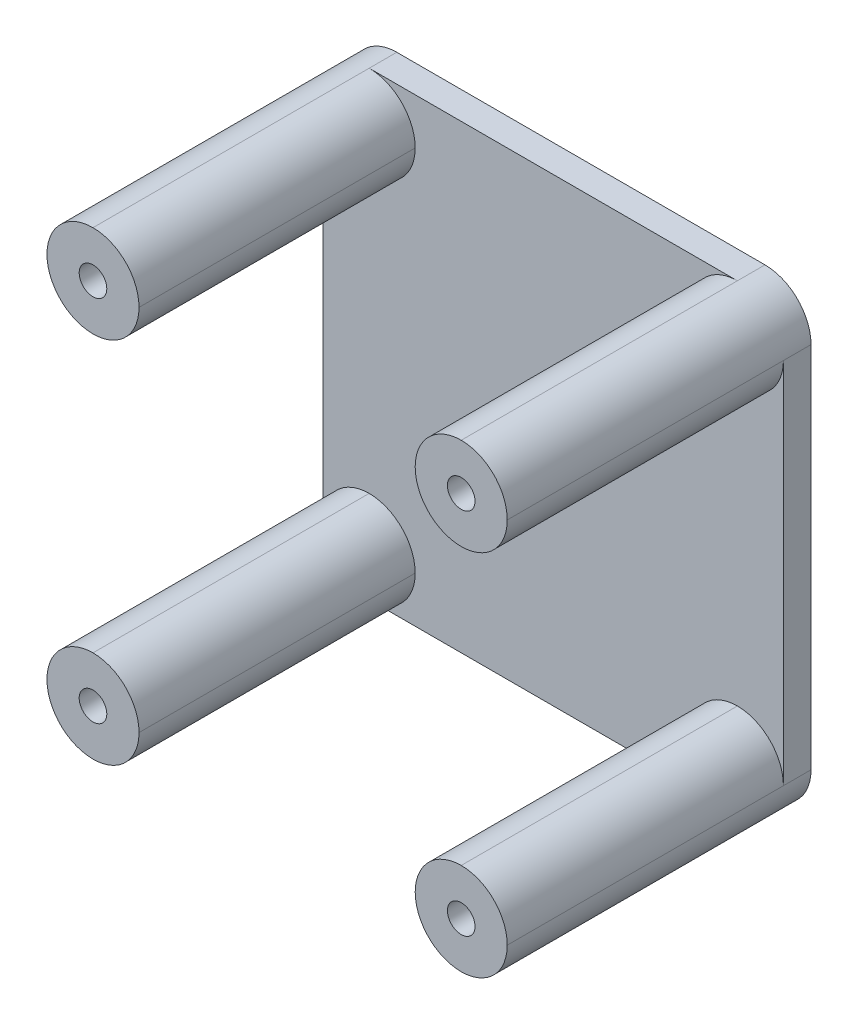
ISO-10303-21;
HEADER;
FILE_DESCRIPTION(('STEP AP214'),'2;1');
FILE_NAME('part.step','',(''),(''),'','','');
FILE_SCHEMA(('AUTOMOTIVE_DESIGN { 1 0 10303 214 1 1 1 1 }'));
ENDSEC;
DATA;
#1=APPLICATION_CONTEXT('core data for automotive mechanical design processes');
#2=APPLICATION_PROTOCOL_DEFINITION('international standard','automotive_design',2000,#1);
#3=PRODUCT_CONTEXT('',#1,'mechanical');
#4=PRODUCT('Part','Part','',(#3));
#5=PRODUCT_RELATED_PRODUCT_CATEGORY('part','',(#4));
#6=PRODUCT_DEFINITION_FORMATION('','',#4);
#7=PRODUCT_DEFINITION_CONTEXT('part definition',#1,'design');
#8=PRODUCT_DEFINITION('design','',#6,#7);
#9=PRODUCT_DEFINITION_SHAPE('','',#8);
#10=(LENGTH_UNIT() NAMED_UNIT(*) SI_UNIT(.MILLI.,.METRE.));
#11=(NAMED_UNIT(*) PLANE_ANGLE_UNIT() SI_UNIT($,.RADIAN.));
#12=(NAMED_UNIT(*) SI_UNIT($,.STERADIAN.) SOLID_ANGLE_UNIT());
#13=UNCERTAINTY_MEASURE_WITH_UNIT(LENGTH_MEASURE(1.E-05),#10,'distance_accuracy_value','');
#14=(GEOMETRIC_REPRESENTATION_CONTEXT(3) GLOBAL_UNCERTAINTY_ASSIGNED_CONTEXT((#13)) GLOBAL_UNIT_ASSIGNED_CONTEXT((#10,
#11,#12)) REPRESENTATION_CONTEXT('',''));
#15=CARTESIAN_POINT('',(0.,0.,0.));
#16=DIRECTION('',(0.,0.,1.));
#17=DIRECTION('',(1.,0.,0.));
#18=AXIS2_PLACEMENT_3D('',#15,#16,#17);
#19=CARTESIAN_POINT('',(0.,0.,3.));
#20=DIRECTION('',(0.,0.,1.));
#21=DIRECTION('',(1.,0.,0.));
#22=AXIS2_PLACEMENT_3D('',#19,#20,#21);
#23=PLANE('',#22);
#24=CARTESIAN_POINT('',(-41.578185930362,67.6844876121973,3.));
#25=DIRECTION('',(0.,0.,1.));
#26=DIRECTION('',(1.,0.,0.));
#27=AXIS2_PLACEMENT_3D('',#24,#25,#26);
#28=CIRCLE('',#27,1.25);
#29=CARTESIAN_POINT('',(-40.328185930362,67.6844876121973,3.));
#30=VERTEX_POINT('',#29);
#31=EDGE_CURVE('E451',#30,#30,#28,.T.);
#32=ORIENTED_EDGE('',*,*,#31,.F.);
#33=EDGE_LOOP('',(#32));
#34=FACE_BOUND('',#33,.T.);
#35=DIRECTION('',(0.,-1.,0.));
#36=VECTOR('',#35,1.);
#37=CARTESIAN_POINT('',(-66.578185930362,0.,3.));
#38=LINE('',#37,#36);
#39=CARTESIAN_POINT('',(-66.578185930362,87.6844876121973,3.));
#40=VERTEX_POINT('',#39);
#41=CARTESIAN_POINT('',(-66.578185930362,47.6844876121973,3.));
#42=VERTEX_POINT('',#41);
#43=EDGE_CURVE('E398',#40,#42,#38,.T.);
#44=ORIENTED_EDGE('',*,*,#43,.T.);
#45=CARTESIAN_POINT('',(-61.578185930362,47.6844876121973,3.));
#46=DIRECTION('',(0.,0.,1.));
#47=DIRECTION('',(1.,0.,0.));
#48=AXIS2_PLACEMENT_3D('',#45,#46,#47);
#49=CIRCLE('',#48,5.);
#50=CARTESIAN_POINT('',(-61.578185930362,52.6844876121973,3.));
#51=VERTEX_POINT('',#50);
#52=EDGE_CURVE('E341',#42,#51,#49,.F.);
#53=ORIENTED_EDGE('',*,*,#52,.T.);
#54=CARTESIAN_POINT('',(-61.578185930362,47.6844876121973,3.));
#55=DIRECTION('',(0.,0.,1.));
#56=DIRECTION('',(1.,0.,0.));
#57=AXIS2_PLACEMENT_3D('',#54,#55,#56);
#58=CIRCLE('',#57,5.);
#59=CARTESIAN_POINT('',(-56.578185930362,47.6844876121973,3.));
#60=VERTEX_POINT('',#59);
#61=EDGE_CURVE('E338',#51,#60,#58,.F.);
#62=ORIENTED_EDGE('',*,*,#61,.T.);
#63=CARTESIAN_POINT('',(-61.578185930362,47.6844876121973,3.));
#64=DIRECTION('',(0.,0.,1.));
#65=DIRECTION('',(1.,0.,0.));
#66=AXIS2_PLACEMENT_3D('',#63,#64,#65);
#67=CIRCLE('',#66,5.);
#68=CARTESIAN_POINT('',(-61.578185930362,42.6844876121973,3.));
#69=VERTEX_POINT('',#68);
#70=EDGE_CURVE('E335',#60,#69,#67,.F.);
#71=ORIENTED_EDGE('',*,*,#70,.T.);
#72=DIRECTION('',(1.,0.,0.));
#73=VECTOR('',#72,1.);
#74=CARTESIAN_POINT('',(0.,42.6844876121973,3.));
#75=LINE('',#74,#73);
#76=CARTESIAN_POINT('',(-21.578185930362,42.6844876121973,3.));
#77=VERTEX_POINT('',#76);
#78=EDGE_CURVE('E185',#69,#77,#75,.T.);
#79=ORIENTED_EDGE('',*,*,#78,.T.);
#80=CARTESIAN_POINT('',(-21.578185930362,47.6844876121973,3.));
#81=DIRECTION('',(0.,0.,1.));
#82=DIRECTION('',(1.,0.,0.));
#83=AXIS2_PLACEMENT_3D('',#80,#81,#82);
#84=CIRCLE('',#83,5.);
#85=CARTESIAN_POINT('',(-26.578185930362,47.6844876121973,3.));
#86=VERTEX_POINT('',#85);
#87=EDGE_CURVE('E332',#77,#86,#84,.F.);
#88=ORIENTED_EDGE('',*,*,#87,.T.);
#89=CARTESIAN_POINT('',(-21.578185930362,47.6844876121973,3.));
#90=DIRECTION('',(0.,0.,1.));
#91=DIRECTION('',(1.,0.,0.));
#92=AXIS2_PLACEMENT_3D('',#89,#90,#91);
#93=CIRCLE('',#92,5.);
#94=CARTESIAN_POINT('',(-21.578185930362,52.6844876121973,3.));
#95=VERTEX_POINT('',#94);
#96=EDGE_CURVE('E329',#86,#95,#93,.F.);
#97=ORIENTED_EDGE('',*,*,#96,.T.);
#98=CARTESIAN_POINT('',(-21.578185930362,47.6844876121973,3.));
#99=DIRECTION('',(0.,0.,1.));
#100=DIRECTION('',(1.,0.,0.));
#101=AXIS2_PLACEMENT_3D('',#98,#99,#100);
#102=CIRCLE('',#101,5.);
#103=CARTESIAN_POINT('',(-16.578185930362,47.6844876121973,3.));
#104=VERTEX_POINT('',#103);
#105=EDGE_CURVE('E325',#95,#104,#102,.F.);
#106=ORIENTED_EDGE('',*,*,#105,.T.);
#107=DIRECTION('',(0.,-1.,0.));
#108=VECTOR('',#107,1.);
#109=CARTESIAN_POINT('',(-16.578185930362,0.,3.));
#110=LINE('',#109,#108);
#111=CARTESIAN_POINT('',(-16.578185930362,87.6844876121973,3.));
#112=VERTEX_POINT('',#111);
#113=EDGE_CURVE('E219',#112,#104,#110,.T.);
#114=ORIENTED_EDGE('',*,*,#113,.F.);
#115=CARTESIAN_POINT('',(-21.578185930362,87.6844876121973,3.));
#116=DIRECTION('',(0.,0.,1.));
#117=DIRECTION('',(1.,0.,0.));
#118=AXIS2_PLACEMENT_3D('',#115,#116,#117);
#119=CIRCLE('',#118,5.);
#120=CARTESIAN_POINT('',(-21.578185930362,82.6844876121973,3.));
#121=VERTEX_POINT('',#120);
#122=EDGE_CURVE('E315',#112,#121,#119,.F.);
#123=ORIENTED_EDGE('',*,*,#122,.T.);
#124=CARTESIAN_POINT('',(-21.578185930362,87.6844876121973,3.));
#125=DIRECTION('',(0.,0.,1.));
#126=DIRECTION('',(1.,0.,0.));
#127=AXIS2_PLACEMENT_3D('',#124,#125,#126);
#128=CIRCLE('',#127,5.);
#129=CARTESIAN_POINT('',(-26.578185930362,87.6844876121973,3.));
#130=VERTEX_POINT('',#129);
#131=EDGE_CURVE('E318',#121,#130,#128,.F.);
#132=ORIENTED_EDGE('',*,*,#131,.T.);
#133=CARTESIAN_POINT('',(-21.578185930362,87.6844876121973,3.));
#134=DIRECTION('',(0.,0.,1.));
#135=DIRECTION('',(1.,0.,0.));
#136=AXIS2_PLACEMENT_3D('',#133,#134,#135);
#137=CIRCLE('',#136,5.);
#138=CARTESIAN_POINT('',(-21.578185930362,92.6844876121973,3.));
#139=VERTEX_POINT('',#138);
#140=EDGE_CURVE('E321',#130,#139,#137,.F.);
#141=ORIENTED_EDGE('',*,*,#140,.T.);
#142=DIRECTION('',(1.,0.,0.));
#143=VECTOR('',#142,1.);
#144=CARTESIAN_POINT('',(0.,92.6844876121973,3.));
#145=LINE('',#144,#143);
#146=CARTESIAN_POINT('',(-61.578185930362,92.6844876121973,3.));
#147=VERTEX_POINT('',#146);
#148=EDGE_CURVE('E403',#147,#139,#145,.T.);
#149=ORIENTED_EDGE('',*,*,#148,.F.);
#150=CARTESIAN_POINT('',(-61.578185930362,87.6844876121973,3.));
#151=DIRECTION('',(0.,0.,1.));
#152=DIRECTION('',(1.,0.,0.));
#153=AXIS2_PLACEMENT_3D('',#150,#151,#152);
#154=CIRCLE('',#153,5.);
#155=CARTESIAN_POINT('',(-56.578185930362,87.6844876121973,3.));
#156=VERTEX_POINT('',#155);
#157=EDGE_CURVE('E11',#147,#156,#154,.F.);
#158=ORIENTED_EDGE('',*,*,#157,.T.);
#159=CARTESIAN_POINT('',(-61.578185930362,87.6844876121973,3.));
#160=DIRECTION('',(0.,0.,1.));
#161=DIRECTION('',(1.,0.,0.));
#162=AXIS2_PLACEMENT_3D('',#159,#160,#161);
#163=CIRCLE('',#162,5.);
#164=CARTESIAN_POINT('',(-61.578185930362,82.6844876121973,3.));
#165=VERTEX_POINT('',#164);
#166=EDGE_CURVE('E51',#156,#165,#163,.F.);
#167=ORIENTED_EDGE('',*,*,#166,.T.);
#168=CARTESIAN_POINT('',(-61.578185930362,87.6844876121973,3.));
#169=DIRECTION('',(0.,0.,1.));
#170=DIRECTION('',(1.,0.,0.));
#171=AXIS2_PLACEMENT_3D('',#168,#169,#170);
#172=CIRCLE('',#171,5.);
#173=EDGE_CURVE('E344',#165,#40,#172,.F.);
#174=ORIENTED_EDGE('',*,*,#173,.T.);
#175=EDGE_LOOP('',(#44,#53,#62,#71,#79,#88,#97,#106,#114,#123,#132,#141,#149,#158,#167,#174));
#176=FACE_BOUND('',#175,.T.);
#177=ADVANCED_FACE('F41',(#34,#176),#23,.T.);
#178=CARTESIAN_POINT('',(-16.578185930362,0.,3.));
#179=DIRECTION('',(1.,0.,0.));
#180=DIRECTION('',(0.,1.,0.));
#181=AXIS2_PLACEMENT_3D('',#178,#179,#180);
#182=PLANE('',#181);
#183=DIRECTION('',(0.,0.,-1.));
#184=VECTOR('',#183,1.);
#185=CARTESIAN_POINT('',(-16.578185930362,87.6844876121973,3.));
#186=LINE('',#185,#184);
#187=CARTESIAN_POINT('',(-16.578185930362,87.6844876121973,0.));
#188=VERTEX_POINT('',#187);
#189=EDGE_CURVE('E249',#188,#112,#186,.F.);
#190=ORIENTED_EDGE('',*,*,#189,.T.);
#191=ORIENTED_EDGE('',*,*,#113,.T.);
#192=DIRECTION('',(0.,0.,-1.));
#193=VECTOR('',#192,1.);
#194=CARTESIAN_POINT('',(-16.578185930362,47.6844876121973,0.));
#195=LINE('',#194,#193);
#196=CARTESIAN_POINT('',(-16.578185930362,47.6844876121973,0.));
#197=VERTEX_POINT('',#196);
#198=EDGE_CURVE('E253',#104,#197,#195,.T.);
#199=ORIENTED_EDGE('',*,*,#198,.T.);
#200=DIRECTION('',(0.,-1.,0.));
#201=VECTOR('',#200,1.);
#202=CARTESIAN_POINT('',(-16.578185930362,0.,0.));
#203=LINE('',#202,#201);
#204=EDGE_CURVE('E470',#188,#197,#203,.T.);
#205=ORIENTED_EDGE('',*,*,#204,.F.);
#206=EDGE_LOOP('',(#190,#191,#199,#205));
#207=FACE_BOUND('',#206,.T.);
#208=ADVANCED_FACE('F489',(#207),#182,.T.);
#209=CARTESIAN_POINT('',(0.,92.6844876121973,3.));
#210=DIRECTION('',(0.,1.,0.));
#211=DIRECTION('',(0.,0.,1.));
#212=AXIS2_PLACEMENT_3D('',#209,#210,#211);
#213=PLANE('',#212);
#214=ORIENTED_EDGE('',*,*,#148,.T.);
#215=DIRECTION('',(0.,0.,-1.));
#216=VECTOR('',#215,1.);
#217=CARTESIAN_POINT('',(-21.578185930362,92.6844876121973,3.));
#218=LINE('',#217,#216);
#219=CARTESIAN_POINT('',(-21.578185930362,92.6844876121973,0.));
#220=VERTEX_POINT('',#219);
#221=EDGE_CURVE('E267',#139,#220,#218,.T.);
#222=ORIENTED_EDGE('',*,*,#221,.T.);
#223=DIRECTION('',(1.,0.,0.));
#224=VECTOR('',#223,1.);
#225=CARTESIAN_POINT('',(0.,92.6844876121973,0.));
#226=LINE('',#225,#224);
#227=CARTESIAN_POINT('',(-61.578185930362,92.6844876121973,0.));
#228=VERTEX_POINT('',#227);
#229=EDGE_CURVE('E221',#228,#220,#226,.T.);
#230=ORIENTED_EDGE('',*,*,#229,.F.);
#231=DIRECTION('',(0.,0.,-1.));
#232=VECTOR('',#231,1.);
#233=CARTESIAN_POINT('',(-61.578185930362,92.6844876121973,33.));
#234=LINE('',#233,#232);
#235=EDGE_CURVE('E263',#228,#147,#234,.F.);
#236=ORIENTED_EDGE('',*,*,#235,.T.);
#237=EDGE_LOOP('',(#214,#222,#230,#236));
#238=FACE_BOUND('',#237,.T.);
#239=ADVANCED_FACE('F478',(#238),#213,.T.);
#240=CARTESIAN_POINT('',(-66.578185930362,0.,3.));
#241=DIRECTION('',(1.,0.,0.));
#242=DIRECTION('',(0.,0.,-1.));
#243=AXIS2_PLACEMENT_3D('',#240,#241,#242);
#244=PLANE('',#243);
#245=DIRECTION('',(0.,0.,-1.));
#246=VECTOR('',#245,1.);
#247=CARTESIAN_POINT('',(-66.578185930362,47.6844876121973,3.));
#248=LINE('',#247,#246);
#249=CARTESIAN_POINT('',(-66.578185930362,47.6844876121973,0.));
#250=VERTEX_POINT('',#249);
#251=EDGE_CURVE('E200',#250,#42,#248,.F.);
#252=ORIENTED_EDGE('',*,*,#251,.T.);
#253=ORIENTED_EDGE('',*,*,#43,.F.);
#254=DIRECTION('',(0.,0.,-1.));
#255=VECTOR('',#254,1.);
#256=CARTESIAN_POINT('',(-66.578185930362,87.6844876121973,0.));
#257=LINE('',#256,#255);
#258=CARTESIAN_POINT('',(-66.578185930362,87.6844876121973,0.));
#259=VERTEX_POINT('',#258);
#260=EDGE_CURVE('E205',#40,#259,#257,.T.);
#261=ORIENTED_EDGE('',*,*,#260,.T.);
#262=DIRECTION('',(0.,-1.,0.));
#263=VECTOR('',#262,1.);
#264=CARTESIAN_POINT('',(-66.578185930362,0.,0.));
#265=LINE('',#264,#263);
#266=EDGE_CURVE('E214',#259,#250,#265,.T.);
#267=ORIENTED_EDGE('',*,*,#266,.T.);
#268=EDGE_LOOP('',(#252,#253,#261,#267));
#269=FACE_BOUND('',#268,.T.);
#270=ADVANCED_FACE('F409',(#269),#244,.F.);
#271=CARTESIAN_POINT('',(0.,42.6844876121973,3.));
#272=DIRECTION('',(0.,1.,0.));
#273=DIRECTION('',(0.,0.,1.));
#274=AXIS2_PLACEMENT_3D('',#271,#272,#273);
#275=PLANE('',#274);
#276=DIRECTION('',(0.,0.,-1.));
#277=VECTOR('',#276,1.);
#278=CARTESIAN_POINT('',(-21.578185930362,42.6844876121973,33.));
#279=LINE('',#278,#277);
#280=CARTESIAN_POINT('',(-21.578185930362,42.6844876121973,0.));
#281=VERTEX_POINT('',#280);
#282=EDGE_CURVE('E192',#281,#77,#279,.F.);
#283=ORIENTED_EDGE('',*,*,#282,.T.);
#284=ORIENTED_EDGE('',*,*,#78,.F.);
#285=DIRECTION('',(0.,0.,-1.));
#286=VECTOR('',#285,1.);
#287=CARTESIAN_POINT('',(-61.578185930362,42.6844876121973,3.));
#288=LINE('',#287,#286);
#289=CARTESIAN_POINT('',(-61.578185930362,42.6844876121973,0.));
#290=VERTEX_POINT('',#289);
#291=EDGE_CURVE('E178',#69,#290,#288,.T.);
#292=ORIENTED_EDGE('',*,*,#291,.T.);
#293=DIRECTION('',(1.,0.,0.));
#294=VECTOR('',#293,1.);
#295=CARTESIAN_POINT('',(0.,42.6844876121973,0.));
#296=LINE('',#295,#294);
#297=EDGE_CURVE('E183',#290,#281,#296,.T.);
#298=ORIENTED_EDGE('',*,*,#297,.T.);
#299=EDGE_LOOP('',(#283,#284,#292,#298));
#300=FACE_BOUND('',#299,.T.);
#301=ADVANCED_FACE('F181',(#300),#275,.F.);
#302=CARTESIAN_POINT('',(-61.578185930362,87.6844876121973,3.));
#303=DIRECTION('',(0.,0.,-1.));
#304=DIRECTION('',(-1.,0.,0.));
#305=AXIS2_PLACEMENT_3D('',#302,#303,#304);
#306=CYLINDRICAL_SURFACE('',#305,1.5);
#307=CARTESIAN_POINT('',(-61.578185930362,87.6844876121973,0.));
#308=DIRECTION('',(0.,0.,1.));
#309=DIRECTION('',(1.,0.,0.));
#310=AXIS2_PLACEMENT_3D('',#307,#308,#309);
#311=CIRCLE('',#310,1.5);
#312=CARTESIAN_POINT('',(-60.078185930362,87.6844876121973,0.));
#313=VERTEX_POINT('',#312);
#314=EDGE_CURVE('E466',#313,#313,#311,.T.);
#315=ORIENTED_EDGE('',*,*,#314,.F.);
#316=EDGE_LOOP('',(#315));
#317=FACE_BOUND('',#316,.T.);
#318=CARTESIAN_POINT('',(-61.578185930362,87.6844876121973,33.));
#319=DIRECTION('',(0.,0.,1.));
#320=DIRECTION('',(1.,0.,0.));
#321=AXIS2_PLACEMENT_3D('',#318,#319,#320);
#322=CIRCLE('',#321,1.5);
#323=CARTESIAN_POINT('',(-60.078185930362,87.6844876121973,33.));
#324=VERTEX_POINT('',#323);
#325=EDGE_CURVE('E440',#324,#324,#322,.T.);
#326=ORIENTED_EDGE('',*,*,#325,.T.);
#327=EDGE_LOOP('',(#326));
#328=FACE_BOUND('',#327,.T.);
#329=ADVANCED_FACE('F550',(#317,#328),#306,.F.);
#330=CARTESIAN_POINT('',(-21.578185930362,87.6844876121973,3.));
#331=DIRECTION('',(0.,0.,-1.));
#332=DIRECTION('',(-1.,0.,0.));
#333=AXIS2_PLACEMENT_3D('',#330,#331,#332);
#334=CYLINDRICAL_SURFACE('',#333,1.5);
#335=CARTESIAN_POINT('',(-21.578185930362,87.6844876121973,0.));
#336=DIRECTION('',(0.,0.,1.));
#337=DIRECTION('',(1.,0.,0.));
#338=AXIS2_PLACEMENT_3D('',#335,#336,#337);
#339=CIRCLE('',#338,1.5);
#340=CARTESIAN_POINT('',(-20.078185930362,87.6844876121973,0.));
#341=VERTEX_POINT('',#340);
#342=EDGE_CURVE('E462',#341,#341,#339,.T.);
#343=ORIENTED_EDGE('',*,*,#342,.F.);
#344=EDGE_LOOP('',(#343));
#345=FACE_BOUND('',#344,.T.);
#346=CARTESIAN_POINT('',(-21.578185930362,87.6844876121973,33.));
#347=DIRECTION('',(0.,0.,1.));
#348=DIRECTION('',(1.,0.,0.));
#349=AXIS2_PLACEMENT_3D('',#346,#347,#348);
#350=CIRCLE('',#349,1.5);
#351=CARTESIAN_POINT('',(-20.078185930362,87.6844876121973,33.));
#352=VERTEX_POINT('',#351);
#353=EDGE_CURVE('E434',#352,#352,#350,.T.);
#354=ORIENTED_EDGE('',*,*,#353,.T.);
#355=EDGE_LOOP('',(#354));
#356=FACE_BOUND('',#355,.T.);
#357=ADVANCED_FACE('F529',(#345,#356),#334,.F.);
#358=CARTESIAN_POINT('',(-61.578185930362,47.6844876121973,3.));
#359=DIRECTION('',(0.,0.,-1.));
#360=DIRECTION('',(-1.,0.,0.));
#361=AXIS2_PLACEMENT_3D('',#358,#359,#360);
#362=CYLINDRICAL_SURFACE('',#361,1.5);
#363=CARTESIAN_POINT('',(-61.578185930362,47.6844876121973,0.));
#364=DIRECTION('',(0.,0.,1.));
#365=DIRECTION('',(1.,0.,0.));
#366=AXIS2_PLACEMENT_3D('',#363,#364,#365);
#367=CIRCLE('',#366,1.5);
#368=CARTESIAN_POINT('',(-60.078185930362,47.6844876121973,0.));
#369=VERTEX_POINT('',#368);
#370=EDGE_CURVE('E458',#369,#369,#367,.T.);
#371=ORIENTED_EDGE('',*,*,#370,.F.);
#372=EDGE_LOOP('',(#371));
#373=FACE_BOUND('',#372,.T.);
#374=CARTESIAN_POINT('',(-61.578185930362,47.6844876121973,33.));
#375=DIRECTION('',(0.,0.,1.));
#376=DIRECTION('',(1.,0.,0.));
#377=AXIS2_PLACEMENT_3D('',#374,#375,#376);
#378=CIRCLE('',#377,1.5);
#379=CARTESIAN_POINT('',(-60.078185930362,47.6844876121973,33.));
#380=VERTEX_POINT('',#379);
#381=EDGE_CURVE('E358',#380,#380,#378,.T.);
#382=ORIENTED_EDGE('',*,*,#381,.T.);
#383=EDGE_LOOP('',(#382));
#384=FACE_BOUND('',#383,.T.);
#385=ADVANCED_FACE('F520',(#373,#384),#362,.F.);
#386=CARTESIAN_POINT('',(-21.578185930362,47.6844876121973,3.));
#387=DIRECTION('',(0.,0.,-1.));
#388=DIRECTION('',(-1.,0.,0.));
#389=AXIS2_PLACEMENT_3D('',#386,#387,#388);
#390=CYLINDRICAL_SURFACE('',#389,1.5);
#391=CARTESIAN_POINT('',(-21.578185930362,47.6844876121973,0.));
#392=DIRECTION('',(0.,0.,1.));
#393=DIRECTION('',(1.,0.,0.));
#394=AXIS2_PLACEMENT_3D('',#391,#392,#393);
#395=CIRCLE('',#394,1.5);
#396=CARTESIAN_POINT('',(-20.078185930362,47.6844876121973,0.));
#397=VERTEX_POINT('',#396);
#398=EDGE_CURVE('E444',#397,#397,#395,.T.);
#399=ORIENTED_EDGE('',*,*,#398,.F.);
#400=EDGE_LOOP('',(#399));
#401=FACE_BOUND('',#400,.T.);
#402=CARTESIAN_POINT('',(-21.578185930362,47.6844876121973,33.));
#403=DIRECTION('',(0.,0.,1.));
#404=DIRECTION('',(1.,0.,0.));
#405=AXIS2_PLACEMENT_3D('',#402,#403,#404);
#406=CIRCLE('',#405,1.5);
#407=CARTESIAN_POINT('',(-20.078185930362,47.6844876121973,33.));
#408=VERTEX_POINT('',#407);
#409=EDGE_CURVE('E430',#408,#408,#406,.T.);
#410=ORIENTED_EDGE('',*,*,#409,.T.);
#411=EDGE_LOOP('',(#410));
#412=FACE_BOUND('',#411,.T.);
#413=ADVANCED_FACE('F517',(#401,#412),#390,.F.);
#414=CARTESIAN_POINT('',(-41.578185930362,67.6844876121973,3.));
#415=DIRECTION('',(0.,0.,-1.));
#416=DIRECTION('',(-1.,0.,0.));
#417=AXIS2_PLACEMENT_3D('',#414,#415,#416);
#418=CYLINDRICAL_SURFACE('',#417,1.25);
#419=ORIENTED_EDGE('',*,*,#31,.T.);
#420=EDGE_LOOP('',(#419));
#421=FACE_BOUND('',#420,.T.);
#422=CARTESIAN_POINT('',(-41.578185930362,67.6844876121973,0.));
#423=DIRECTION('',(0.,0.,1.));
#424=DIRECTION('',(1.,0.,0.));
#425=AXIS2_PLACEMENT_3D('',#422,#423,#424);
#426=CIRCLE('',#425,1.25);
#427=CARTESIAN_POINT('',(-40.328185930362,67.6844876121973,0.));
#428=VERTEX_POINT('',#427);
#429=EDGE_CURVE('E213',#428,#428,#426,.T.);
#430=ORIENTED_EDGE('',*,*,#429,.F.);
#431=EDGE_LOOP('',(#430));
#432=FACE_BOUND('',#431,.T.);
#433=ADVANCED_FACE('F519',(#421,#432),#418,.F.);
#434=CARTESIAN_POINT('',(0.,0.,0.));
#435=DIRECTION('',(0.,0.,1.));
#436=DIRECTION('',(1.,0.,0.));
#437=AXIS2_PLACEMENT_3D('',#434,#435,#436);
#438=PLANE('',#437);
#439=ORIENTED_EDGE('',*,*,#398,.T.);
#440=EDGE_LOOP('',(#439));
#441=FACE_BOUND('',#440,.T.);
#442=ORIENTED_EDGE('',*,*,#370,.T.);
#443=EDGE_LOOP('',(#442));
#444=FACE_BOUND('',#443,.T.);
#445=ORIENTED_EDGE('',*,*,#342,.T.);
#446=EDGE_LOOP('',(#445));
#447=FACE_BOUND('',#446,.T.);
#448=ORIENTED_EDGE('',*,*,#314,.T.);
#449=EDGE_LOOP('',(#448));
#450=FACE_BOUND('',#449,.T.);
#451=ORIENTED_EDGE('',*,*,#297,.F.);
#452=CARTESIAN_POINT('',(-61.578185930362,47.6844876121973,0.));
#453=DIRECTION('',(0.,0.,1.));
#454=DIRECTION('',(1.,0.,0.));
#455=AXIS2_PLACEMENT_3D('',#452,#453,#454);
#456=CIRCLE('',#455,5.);
#457=EDGE_CURVE('E195',#290,#250,#456,.F.);
#458=ORIENTED_EDGE('',*,*,#457,.T.);
#459=ORIENTED_EDGE('',*,*,#266,.F.);
#460=CARTESIAN_POINT('',(-61.578185930362,87.6844876121973,0.));
#461=DIRECTION('',(0.,0.,1.));
#462=DIRECTION('',(1.,0.,0.));
#463=AXIS2_PLACEMENT_3D('',#460,#461,#462);
#464=CIRCLE('',#463,5.);
#465=EDGE_CURVE('E229',#259,#228,#464,.F.);
#466=ORIENTED_EDGE('',*,*,#465,.T.);
#467=ORIENTED_EDGE('',*,*,#229,.T.);
#468=CARTESIAN_POINT('',(-21.578185930362,87.6844876121973,0.));
#469=DIRECTION('',(0.,0.,1.));
#470=DIRECTION('',(1.,0.,0.));
#471=AXIS2_PLACEMENT_3D('',#468,#469,#470);
#472=CIRCLE('',#471,5.);
#473=EDGE_CURVE('E232',#220,#188,#472,.F.);
#474=ORIENTED_EDGE('',*,*,#473,.T.);
#475=ORIENTED_EDGE('',*,*,#204,.T.);
#476=CARTESIAN_POINT('',(-21.578185930362,47.6844876121973,0.));
#477=DIRECTION('',(0.,0.,1.));
#478=DIRECTION('',(1.,0.,0.));
#479=AXIS2_PLACEMENT_3D('',#476,#477,#478);
#480=CIRCLE('',#479,5.);
#481=EDGE_CURVE('E206',#197,#281,#480,.F.);
#482=ORIENTED_EDGE('',*,*,#481,.T.);
#483=EDGE_LOOP('',(#451,#458,#459,#466,#467,#474,#475,#482));
#484=FACE_BOUND('',#483,.T.);
#485=ORIENTED_EDGE('',*,*,#429,.T.);
#486=EDGE_LOOP('',(#485));
#487=FACE_BOUND('',#486,.T.);
#488=ADVANCED_FACE('F208',(#441,#444,#447,#450,#484,#487),#438,.F.);
#489=CARTESIAN_POINT('',(0.,0.,33.));
#490=DIRECTION('',(0.,0.,1.));
#491=DIRECTION('',(1.,0.,0.));
#492=AXIS2_PLACEMENT_3D('',#489,#490,#491);
#493=PLANE('',#492);
#494=CARTESIAN_POINT('',(-61.578185930362,87.6844876121973,33.));
#495=DIRECTION('',(0.,0.,1.));
#496=DIRECTION('',(1.,0.,0.));
#497=AXIS2_PLACEMENT_3D('',#494,#495,#496);
#498=CIRCLE('',#497,5.);
#499=CARTESIAN_POINT('',(-61.578185930362,92.6844876121973,33.));
#500=VERTEX_POINT('',#499);
#501=CARTESIAN_POINT('',(-66.578185930362,87.6844876121973,33.));
#502=VERTEX_POINT('',#501);
#503=EDGE_CURVE('E275',#500,#502,#498,.T.);
#504=ORIENTED_EDGE('',*,*,#503,.T.);
#505=CARTESIAN_POINT('',(-61.578185930362,87.6844876121973,33.));
#506=DIRECTION('',(0.,0.,1.));
#507=DIRECTION('',(1.,0.,0.));
#508=AXIS2_PLACEMENT_3D('',#505,#506,#507);
#509=CIRCLE('',#508,5.);
#510=CARTESIAN_POINT('',(-61.578185930362,82.6844876121973,33.));
#511=VERTEX_POINT('',#510);
#512=EDGE_CURVE('E312',#502,#511,#509,.T.);
#513=ORIENTED_EDGE('',*,*,#512,.T.);
#514=CARTESIAN_POINT('',(-61.578185930362,87.6844876121973,33.));
#515=DIRECTION('',(0.,0.,1.));
#516=DIRECTION('',(1.,0.,0.));
#517=AXIS2_PLACEMENT_3D('',#514,#515,#516);
#518=CIRCLE('',#517,5.);
#519=CARTESIAN_POINT('',(-56.578185930362,87.6844876121973,33.));
#520=VERTEX_POINT('',#519);
#521=EDGE_CURVE('E309',#511,#520,#518,.T.);
#522=ORIENTED_EDGE('',*,*,#521,.T.);
#523=CARTESIAN_POINT('',(-61.578185930362,87.6844876121973,33.));
#524=DIRECTION('',(0.,0.,1.));
#525=DIRECTION('',(1.,0.,0.));
#526=AXIS2_PLACEMENT_3D('',#523,#524,#525);
#527=CIRCLE('',#526,5.);
#528=EDGE_CURVE('E306',#520,#500,#527,.T.);
#529=ORIENTED_EDGE('',*,*,#528,.T.);
#530=EDGE_LOOP('',(#504,#513,#522,#529));
#531=FACE_BOUND('',#530,.T.);
#532=ORIENTED_EDGE('',*,*,#325,.F.);
#533=EDGE_LOOP('',(#532));
#534=FACE_BOUND('',#533,.T.);
#535=ADVANCED_FACE('F389',(#531,#534),#493,.T.);
#536=CARTESIAN_POINT('',(0.,0.,33.));
#537=DIRECTION('',(0.,0.,-1.));
#538=DIRECTION('',(-1.,0.,0.));
#539=AXIS2_PLACEMENT_3D('',#536,#537,#538);
#540=PLANE('',#539);
#541=CARTESIAN_POINT('',(-21.578185930362,87.6844876121973,33.));
#542=DIRECTION('',(0.,0.,-1.));
#543=DIRECTION('',(-1.,0.,0.));
#544=AXIS2_PLACEMENT_3D('',#541,#542,#543);
#545=CIRCLE('',#544,5.);
#546=CARTESIAN_POINT('',(-26.578185930362,87.6844876121973,33.));
#547=VERTEX_POINT('',#546);
#548=CARTESIAN_POINT('',(-21.578185930362,82.6844876121973,33.));
#549=VERTEX_POINT('',#548);
#550=EDGE_CURVE('E282',#547,#549,#545,.F.);
#551=ORIENTED_EDGE('',*,*,#550,.T.);
#552=CARTESIAN_POINT('',(-21.578185930362,87.6844876121973,33.));
#553=DIRECTION('',(0.,0.,-1.));
#554=DIRECTION('',(-1.,0.,0.));
#555=AXIS2_PLACEMENT_3D('',#552,#553,#554);
#556=CIRCLE('',#555,5.);
#557=CARTESIAN_POINT('',(-16.578185930362,87.6844876121973,33.));
#558=VERTEX_POINT('',#557);
#559=EDGE_CURVE('E285',#549,#558,#556,.F.);
#560=ORIENTED_EDGE('',*,*,#559,.T.);
#561=CARTESIAN_POINT('',(-21.578185930362,87.6844876121973,33.));
#562=DIRECTION('',(0.,0.,-1.));
#563=DIRECTION('',(-1.,0.,0.));
#564=AXIS2_PLACEMENT_3D('',#561,#562,#563);
#565=CIRCLE('',#564,5.);
#566=CARTESIAN_POINT('',(-21.578185930362,92.6844876121973,33.));
#567=VERTEX_POINT('',#566);
#568=EDGE_CURVE('E272',#558,#567,#565,.F.);
#569=ORIENTED_EDGE('',*,*,#568,.T.);
#570=CARTESIAN_POINT('',(-21.578185930362,87.6844876121973,33.));
#571=DIRECTION('',(0.,0.,-1.));
#572=DIRECTION('',(-1.,0.,0.));
#573=AXIS2_PLACEMENT_3D('',#570,#571,#572);
#574=CIRCLE('',#573,5.);
#575=EDGE_CURVE('E279',#567,#547,#574,.F.);
#576=ORIENTED_EDGE('',*,*,#575,.T.);
#577=EDGE_LOOP('',(#551,#560,#569,#576));
#578=FACE_BOUND('',#577,.T.);
#579=ORIENTED_EDGE('',*,*,#353,.F.);
#580=EDGE_LOOP('',(#579));
#581=FACE_BOUND('',#580,.T.);
#582=ADVANCED_FACE('F513',(#578,#581),#540,.F.);
#583=CARTESIAN_POINT('',(0.,0.,33.));
#584=DIRECTION('',(0.,0.,1.));
#585=DIRECTION('',(1.,0.,0.));
#586=AXIS2_PLACEMENT_3D('',#583,#584,#585);
#587=PLANE('',#586);
#588=CARTESIAN_POINT('',(-21.578185930362,47.6844876121973,33.));
#589=DIRECTION('',(0.,0.,1.));
#590=DIRECTION('',(1.,0.,0.));
#591=AXIS2_PLACEMENT_3D('',#588,#589,#590);
#592=CIRCLE('',#591,5.);
#593=CARTESIAN_POINT('',(-21.578185930362,42.6844876121973,33.));
#594=VERTEX_POINT('',#593);
#595=CARTESIAN_POINT('',(-16.578185930362,47.6844876121973,33.));
#596=VERTEX_POINT('',#595);
#597=EDGE_CURVE('E258',#594,#596,#592,.T.);
#598=ORIENTED_EDGE('',*,*,#597,.T.);
#599=CARTESIAN_POINT('',(-21.578185930362,47.6844876121973,33.));
#600=DIRECTION('',(0.,0.,1.));
#601=DIRECTION('',(1.,0.,0.));
#602=AXIS2_PLACEMENT_3D('',#599,#600,#601);
#603=CIRCLE('',#602,5.);
#604=CARTESIAN_POINT('',(-21.578185930362,52.6844876121973,33.));
#605=VERTEX_POINT('',#604);
#606=EDGE_CURVE('E294',#596,#605,#603,.T.);
#607=ORIENTED_EDGE('',*,*,#606,.T.);
#608=CARTESIAN_POINT('',(-21.578185930362,47.6844876121973,33.));
#609=DIRECTION('',(0.,0.,1.));
#610=DIRECTION('',(1.,0.,0.));
#611=AXIS2_PLACEMENT_3D('',#608,#609,#610);
#612=CIRCLE('',#611,5.);
#613=CARTESIAN_POINT('',(-26.578185930362,47.6844876121973,33.));
#614=VERTEX_POINT('',#613);
#615=EDGE_CURVE('E291',#605,#614,#612,.T.);
#616=ORIENTED_EDGE('',*,*,#615,.T.);
#617=CARTESIAN_POINT('',(-21.578185930362,47.6844876121973,33.));
#618=DIRECTION('',(0.,0.,1.));
#619=DIRECTION('',(1.,0.,0.));
#620=AXIS2_PLACEMENT_3D('',#617,#618,#619);
#621=CIRCLE('',#620,5.);
#622=EDGE_CURVE('E288',#614,#594,#621,.T.);
#623=ORIENTED_EDGE('',*,*,#622,.T.);
#624=EDGE_LOOP('',(#598,#607,#616,#623));
#625=FACE_BOUND('',#624,.T.);
#626=ORIENTED_EDGE('',*,*,#409,.F.);
#627=EDGE_LOOP('',(#626));
#628=FACE_BOUND('',#627,.T.);
#629=ADVANCED_FACE('F424',(#625,#628),#587,.T.);
#630=CARTESIAN_POINT('',(0.,0.,33.));
#631=DIRECTION('',(0.,0.,-1.));
#632=DIRECTION('',(-1.,0.,0.));
#633=AXIS2_PLACEMENT_3D('',#630,#631,#632);
#634=PLANE('',#633);
#635=CARTESIAN_POINT('',(-61.578185930362,47.6844876121973,33.));
#636=DIRECTION('',(0.,0.,-1.));
#637=DIRECTION('',(-1.,0.,0.));
#638=AXIS2_PLACEMENT_3D('',#635,#636,#637);
#639=CIRCLE('',#638,5.);
#640=CARTESIAN_POINT('',(-66.578185930362,47.6844876121973,33.));
#641=VERTEX_POINT('',#640);
#642=CARTESIAN_POINT('',(-61.578185930362,42.6844876121973,33.));
#643=VERTEX_POINT('',#642);
#644=EDGE_CURVE('E244',#641,#643,#639,.F.);
#645=ORIENTED_EDGE('',*,*,#644,.T.);
#646=CARTESIAN_POINT('',(-61.578185930362,47.6844876121973,33.));
#647=DIRECTION('',(0.,0.,-1.));
#648=DIRECTION('',(-1.,0.,0.));
#649=AXIS2_PLACEMENT_3D('',#646,#647,#648);
#650=CIRCLE('',#649,5.);
#651=CARTESIAN_POINT('',(-56.578185930362,47.6844876121973,33.));
#652=VERTEX_POINT('',#651);
#653=EDGE_CURVE('E303',#643,#652,#650,.F.);
#654=ORIENTED_EDGE('',*,*,#653,.T.);
#655=CARTESIAN_POINT('',(-61.578185930362,47.6844876121973,33.));
#656=DIRECTION('',(0.,0.,-1.));
#657=DIRECTION('',(-1.,0.,0.));
#658=AXIS2_PLACEMENT_3D('',#655,#656,#657);
#659=CIRCLE('',#658,5.);
#660=CARTESIAN_POINT('',(-61.578185930362,52.6844876121973,33.));
#661=VERTEX_POINT('',#660);
#662=EDGE_CURVE('E300',#652,#661,#659,.F.);
#663=ORIENTED_EDGE('',*,*,#662,.T.);
#664=CARTESIAN_POINT('',(-61.578185930362,47.6844876121973,33.));
#665=DIRECTION('',(0.,0.,-1.));
#666=DIRECTION('',(-1.,0.,0.));
#667=AXIS2_PLACEMENT_3D('',#664,#665,#666);
#668=CIRCLE('',#667,5.);
#669=EDGE_CURVE('E297',#661,#641,#668,.F.);
#670=ORIENTED_EDGE('',*,*,#669,.T.);
#671=EDGE_LOOP('',(#645,#654,#663,#670));
#672=FACE_BOUND('',#671,.T.);
#673=ORIENTED_EDGE('',*,*,#381,.F.);
#674=EDGE_LOOP('',(#673));
#675=FACE_BOUND('',#674,.T.);
#676=ADVANCED_FACE('F421',(#672,#675),#634,.F.);
#677=CARTESIAN_POINT('',(-61.578185930362,47.6844876121973,3.));
#678=DIRECTION('',(0.,0.,-1.));
#679=DIRECTION('',(-1.,0.,0.));
#680=AXIS2_PLACEMENT_3D('',#677,#678,#679);
#681=CYLINDRICAL_SURFACE('',#680,5.);
#682=ORIENTED_EDGE('',*,*,#644,.F.);
#683=EDGE_CURVE('E241',#42,#641,#248,.F.);
#684=ORIENTED_EDGE('',*,*,#683,.F.);
#685=ORIENTED_EDGE('',*,*,#251,.F.);
#686=ORIENTED_EDGE('',*,*,#457,.F.);
#687=ORIENTED_EDGE('',*,*,#291,.F.);
#688=EDGE_CURVE('E191',#643,#69,#288,.T.);
#689=ORIENTED_EDGE('',*,*,#688,.F.);
#690=EDGE_LOOP('',(#682,#684,#685,#686,#687,#689));
#691=FACE_BOUND('',#690,.T.);
#692=ADVANCED_FACE('F197',(#691),#681,.T.);
#693=CARTESIAN_POINT('',(-21.578185930362,47.6844876121973,3.));
#694=DIRECTION('',(0.,0.,1.));
#695=DIRECTION('',(1.,0.,0.));
#696=AXIS2_PLACEMENT_3D('',#693,#694,#695);
#697=CYLINDRICAL_SURFACE('',#696,5.);
#698=ORIENTED_EDGE('',*,*,#597,.F.);
#699=EDGE_CURVE('E226',#77,#594,#279,.F.);
#700=ORIENTED_EDGE('',*,*,#699,.F.);
#701=ORIENTED_EDGE('',*,*,#282,.F.);
#702=ORIENTED_EDGE('',*,*,#481,.F.);
#703=ORIENTED_EDGE('',*,*,#198,.F.);
#704=EDGE_CURVE('E254',#596,#104,#195,.T.);
#705=ORIENTED_EDGE('',*,*,#704,.F.);
#706=EDGE_LOOP('',(#698,#700,#701,#702,#703,#705));
#707=FACE_BOUND('',#706,.T.);
#708=ADVANCED_FACE('F495',(#707),#697,.T.);
#709=CARTESIAN_POINT('',(-21.578185930362,87.6844876121973,3.));
#710=DIRECTION('',(0.,0.,-1.));
#711=DIRECTION('',(-1.,0.,0.));
#712=AXIS2_PLACEMENT_3D('',#709,#710,#711);
#713=CYLINDRICAL_SURFACE('',#712,5.);
#714=ORIENTED_EDGE('',*,*,#568,.F.);
#715=EDGE_CURVE('E248',#112,#558,#186,.F.);
#716=ORIENTED_EDGE('',*,*,#715,.F.);
#717=ORIENTED_EDGE('',*,*,#189,.F.);
#718=ORIENTED_EDGE('',*,*,#473,.F.);
#719=ORIENTED_EDGE('',*,*,#221,.F.);
#720=EDGE_CURVE('E268',#567,#139,#218,.T.);
#721=ORIENTED_EDGE('',*,*,#720,.F.);
#722=EDGE_LOOP('',(#714,#716,#717,#718,#719,#721));
#723=FACE_BOUND('',#722,.T.);
#724=ADVANCED_FACE('F485',(#723),#713,.T.);
#725=CARTESIAN_POINT('',(-61.578185930362,87.6844876121973,3.));
#726=DIRECTION('',(0.,0.,1.));
#727=DIRECTION('',(1.,0.,0.));
#728=AXIS2_PLACEMENT_3D('',#725,#726,#727);
#729=CYLINDRICAL_SURFACE('',#728,5.);
#730=ORIENTED_EDGE('',*,*,#503,.F.);
#731=EDGE_CURVE('E262',#147,#500,#234,.F.);
#732=ORIENTED_EDGE('',*,*,#731,.F.);
#733=ORIENTED_EDGE('',*,*,#235,.F.);
#734=ORIENTED_EDGE('',*,*,#465,.F.);
#735=ORIENTED_EDGE('',*,*,#260,.F.);
#736=EDGE_CURVE('E237',#502,#40,#257,.T.);
#737=ORIENTED_EDGE('',*,*,#736,.F.);
#738=EDGE_LOOP('',(#730,#732,#733,#734,#735,#737));
#739=FACE_BOUND('',#738,.T.);
#740=ADVANCED_FACE('F393',(#739),#729,.T.);
#741=CARTESIAN_POINT('',(-21.578185930362,87.6844876121973,33.));
#742=DIRECTION('',(0.,0.,1.));
#743=DIRECTION('',(1.,0.,0.));
#744=AXIS2_PLACEMENT_3D('',#741,#742,#743);
#745=CYLINDRICAL_SURFACE('',#744,5.);
#746=ORIENTED_EDGE('',*,*,#720,.T.);
#747=ORIENTED_EDGE('',*,*,#140,.F.);
#748=DIRECTION('',(0.,0.,-1.));
#749=VECTOR('',#748,1.);
#750=CARTESIAN_POINT('',(-26.578185930362,87.6844876121973,3.));
#751=LINE('',#750,#749);
#752=EDGE_CURVE('E353',#547,#130,#751,.T.);
#753=ORIENTED_EDGE('',*,*,#752,.F.);
#754=ORIENTED_EDGE('',*,*,#575,.F.);
#755=EDGE_LOOP('',(#746,#747,#753,#754));
#756=FACE_BOUND('',#755,.T.);
#757=ADVANCED_FACE('F588',(#756),#745,.T.);
#758=CARTESIAN_POINT('',(-21.578185930362,87.6844876121973,33.));
#759=DIRECTION('',(0.,0.,-1.));
#760=DIRECTION('',(-1.,0.,0.));
#761=AXIS2_PLACEMENT_3D('',#758,#759,#760);
#762=CYLINDRICAL_SURFACE('',#761,5.);
#763=DIRECTION('',(0.,0.,-1.));
#764=VECTOR('',#763,1.);
#765=CARTESIAN_POINT('',(-21.578185930362,82.6844876121973,33.));
#766=LINE('',#765,#764);
#767=EDGE_CURVE('E349',#549,#121,#766,.T.);
#768=ORIENTED_EDGE('',*,*,#767,.F.);
#769=ORIENTED_EDGE('',*,*,#550,.F.);
#770=ORIENTED_EDGE('',*,*,#752,.T.);
#771=ORIENTED_EDGE('',*,*,#131,.F.);
#772=EDGE_LOOP('',(#768,#769,#770,#771));
#773=FACE_BOUND('',#772,.T.);
#774=ADVANCED_FACE('F578',(#773),#762,.T.);
#775=CARTESIAN_POINT('',(-21.578185930362,87.6844876121973,3.));
#776=DIRECTION('',(0.,0.,1.));
#777=DIRECTION('',(1.,0.,0.));
#778=AXIS2_PLACEMENT_3D('',#775,#776,#777);
#779=CYLINDRICAL_SURFACE('',#778,5.);
#780=ORIENTED_EDGE('',*,*,#559,.F.);
#781=ORIENTED_EDGE('',*,*,#767,.T.);
#782=ORIENTED_EDGE('',*,*,#122,.F.);
#783=ORIENTED_EDGE('',*,*,#715,.T.);
#784=EDGE_LOOP('',(#780,#781,#782,#783));
#785=FACE_BOUND('',#784,.T.);
#786=ADVANCED_FACE('F581',(#785),#779,.T.);
#787=CARTESIAN_POINT('',(-21.578185930362,47.6844876121973,3.));
#788=DIRECTION('',(0.,0.,-1.));
#789=DIRECTION('',(-1.,0.,0.));
#790=AXIS2_PLACEMENT_3D('',#787,#788,#789);
#791=CYLINDRICAL_SURFACE('',#790,5.);
#792=ORIENTED_EDGE('',*,*,#699,.T.);
#793=ORIENTED_EDGE('',*,*,#622,.F.);
#794=DIRECTION('',(0.,0.,-1.));
#795=VECTOR('',#794,1.);
#796=CARTESIAN_POINT('',(-26.578185930362,47.6844876121973,33.));
#797=LINE('',#796,#795);
#798=EDGE_CURVE('E354',#86,#614,#797,.F.);
#799=ORIENTED_EDGE('',*,*,#798,.F.);
#800=ORIENTED_EDGE('',*,*,#87,.F.);
#801=EDGE_LOOP('',(#792,#793,#799,#800));
#802=FACE_BOUND('',#801,.T.);
#803=ADVANCED_FACE('F500',(#802),#791,.T.);
#804=CARTESIAN_POINT('',(-21.578185930362,47.6844876121973,33.));
#805=DIRECTION('',(0.,0.,-1.));
#806=DIRECTION('',(-1.,0.,0.));
#807=AXIS2_PLACEMENT_3D('',#804,#805,#806);
#808=CYLINDRICAL_SURFACE('',#807,5.);
#809=ORIENTED_EDGE('',*,*,#798,.T.);
#810=ORIENTED_EDGE('',*,*,#615,.F.);
#811=DIRECTION('',(0.,0.,-1.));
#812=VECTOR('',#811,1.);
#813=CARTESIAN_POINT('',(-21.578185930362,52.6844876121973,33.));
#814=LINE('',#813,#812);
#815=EDGE_CURVE('E359',#95,#605,#814,.F.);
#816=ORIENTED_EDGE('',*,*,#815,.F.);
#817=ORIENTED_EDGE('',*,*,#96,.F.);
#818=EDGE_LOOP('',(#809,#810,#816,#817));
#819=FACE_BOUND('',#818,.T.);
#820=ADVANCED_FACE('F507',(#819),#808,.T.);
#821=CARTESIAN_POINT('',(-21.578185930362,47.6844876121973,33.));
#822=DIRECTION('',(0.,0.,1.));
#823=DIRECTION('',(1.,0.,0.));
#824=AXIS2_PLACEMENT_3D('',#821,#822,#823);
#825=CYLINDRICAL_SURFACE('',#824,5.);
#826=ORIENTED_EDGE('',*,*,#606,.F.);
#827=ORIENTED_EDGE('',*,*,#704,.T.);
#828=ORIENTED_EDGE('',*,*,#105,.F.);
#829=ORIENTED_EDGE('',*,*,#815,.T.);
#830=EDGE_LOOP('',(#826,#827,#828,#829));
#831=FACE_BOUND('',#830,.T.);
#832=ADVANCED_FACE('F509',(#831),#825,.T.);
#833=CARTESIAN_POINT('',(-61.578185930362,47.6844876121973,3.));
#834=DIRECTION('',(0.,0.,-1.));
#835=DIRECTION('',(-1.,0.,0.));
#836=AXIS2_PLACEMENT_3D('',#833,#834,#835);
#837=CYLINDRICAL_SURFACE('',#836,5.);
#838=ORIENTED_EDGE('',*,*,#683,.T.);
#839=ORIENTED_EDGE('',*,*,#669,.F.);
#840=DIRECTION('',(0.,0.,-1.));
#841=VECTOR('',#840,1.);
#842=CARTESIAN_POINT('',(-61.578185930362,52.6844876121973,33.));
#843=LINE('',#842,#841);
#844=EDGE_CURVE('E363',#51,#661,#843,.F.);
#845=ORIENTED_EDGE('',*,*,#844,.F.);
#846=ORIENTED_EDGE('',*,*,#52,.F.);
#847=EDGE_LOOP('',(#838,#839,#845,#846));
#848=FACE_BOUND('',#847,.T.);
#849=ADVANCED_FACE('F410',(#848),#837,.T.);
#850=CARTESIAN_POINT('',(-61.578185930362,47.6844876121973,33.));
#851=DIRECTION('',(0.,0.,-1.));
#852=DIRECTION('',(-1.,0.,0.));
#853=AXIS2_PLACEMENT_3D('',#850,#851,#852);
#854=CYLINDRICAL_SURFACE('',#853,5.);
#855=ORIENTED_EDGE('',*,*,#844,.T.);
#856=ORIENTED_EDGE('',*,*,#662,.F.);
#857=DIRECTION('',(0.,0.,-1.));
#858=VECTOR('',#857,1.);
#859=CARTESIAN_POINT('',(-56.578185930362,47.6844876121973,33.));
#860=LINE('',#859,#858);
#861=EDGE_CURVE('E367',#60,#652,#860,.F.);
#862=ORIENTED_EDGE('',*,*,#861,.F.);
#863=ORIENTED_EDGE('',*,*,#61,.F.);
#864=EDGE_LOOP('',(#855,#856,#862,#863));
#865=FACE_BOUND('',#864,.T.);
#866=ADVANCED_FACE('F415',(#865),#854,.T.);
#867=CARTESIAN_POINT('',(-61.578185930362,47.6844876121973,33.));
#868=DIRECTION('',(0.,0.,-1.));
#869=DIRECTION('',(-1.,0.,0.));
#870=AXIS2_PLACEMENT_3D('',#867,#868,#869);
#871=CYLINDRICAL_SURFACE('',#870,5.);
#872=ORIENTED_EDGE('',*,*,#653,.F.);
#873=ORIENTED_EDGE('',*,*,#688,.T.);
#874=ORIENTED_EDGE('',*,*,#70,.F.);
#875=ORIENTED_EDGE('',*,*,#861,.T.);
#876=EDGE_LOOP('',(#872,#873,#874,#875));
#877=FACE_BOUND('',#876,.T.);
#878=ADVANCED_FACE('F419',(#877),#871,.T.);
#879=CARTESIAN_POINT('',(-61.578185930362,87.6844876121973,3.));
#880=DIRECTION('',(0.,0.,1.));
#881=DIRECTION('',(1.,0.,0.));
#882=AXIS2_PLACEMENT_3D('',#879,#880,#881);
#883=CYLINDRICAL_SURFACE('',#882,5.);
#884=ORIENTED_EDGE('',*,*,#731,.T.);
#885=ORIENTED_EDGE('',*,*,#528,.F.);
#886=DIRECTION('',(0.,0.,-1.));
#887=VECTOR('',#886,1.);
#888=CARTESIAN_POINT('',(-56.578185930362,87.6844876121973,33.));
#889=LINE('',#888,#887);
#890=EDGE_CURVE('E45',#156,#520,#889,.F.);
#891=ORIENTED_EDGE('',*,*,#890,.F.);
#892=ORIENTED_EDGE('',*,*,#157,.F.);
#893=EDGE_LOOP('',(#884,#885,#891,#892));
#894=FACE_BOUND('',#893,.T.);
#895=ADVANCED_FACE('F43',(#894),#883,.T.);
#896=CARTESIAN_POINT('',(-61.578185930362,87.6844876121973,33.));
#897=DIRECTION('',(0.,0.,-1.));
#898=DIRECTION('',(-1.,0.,0.));
#899=AXIS2_PLACEMENT_3D('',#896,#897,#898);
#900=CYLINDRICAL_SURFACE('',#899,5.);
#901=ORIENTED_EDGE('',*,*,#890,.T.);
#902=ORIENTED_EDGE('',*,*,#521,.F.);
#903=DIRECTION('',(0.,0.,-1.));
#904=VECTOR('',#903,1.);
#905=CARTESIAN_POINT('',(-61.578185930362,82.6844876121973,33.));
#906=LINE('',#905,#904);
#907=EDGE_CURVE('E373',#165,#511,#906,.F.);
#908=ORIENTED_EDGE('',*,*,#907,.F.);
#909=ORIENTED_EDGE('',*,*,#166,.F.);
#910=EDGE_LOOP('',(#901,#902,#908,#909));
#911=FACE_BOUND('',#910,.T.);
#912=ADVANCED_FACE('F382',(#911),#900,.T.);
#913=CARTESIAN_POINT('',(-61.578185930362,87.6844876121973,33.));
#914=DIRECTION('',(0.,0.,-1.));
#915=DIRECTION('',(-1.,0.,0.));
#916=AXIS2_PLACEMENT_3D('',#913,#914,#915);
#917=CYLINDRICAL_SURFACE('',#916,5.);
#918=ORIENTED_EDGE('',*,*,#512,.F.);
#919=ORIENTED_EDGE('',*,*,#736,.T.);
#920=ORIENTED_EDGE('',*,*,#173,.F.);
#921=ORIENTED_EDGE('',*,*,#907,.T.);
#922=EDGE_LOOP('',(#918,#919,#920,#921));
#923=FACE_BOUND('',#922,.T.);
#924=ADVANCED_FACE('F397',(#923),#917,.T.);
#925=CLOSED_SHELL('',(#177,#208,#239,#270,#301,#329,#357,#385,#413,#433,#488,#535,#582,#629,
#676,#692,#708,#724,#740,#757,#774,#786,#803,#820,#832,#849,#866,#878,#895,#912,#924));
#926=MANIFOLD_SOLID_BREP('B2',#925);
#927=ADVANCED_BREP_SHAPE_REPRESENTATION('',(#18,#926),#14);
#928=SHAPE_DEFINITION_REPRESENTATION(#9,#927);
ENDSEC;
END-ISO-10303-21;
